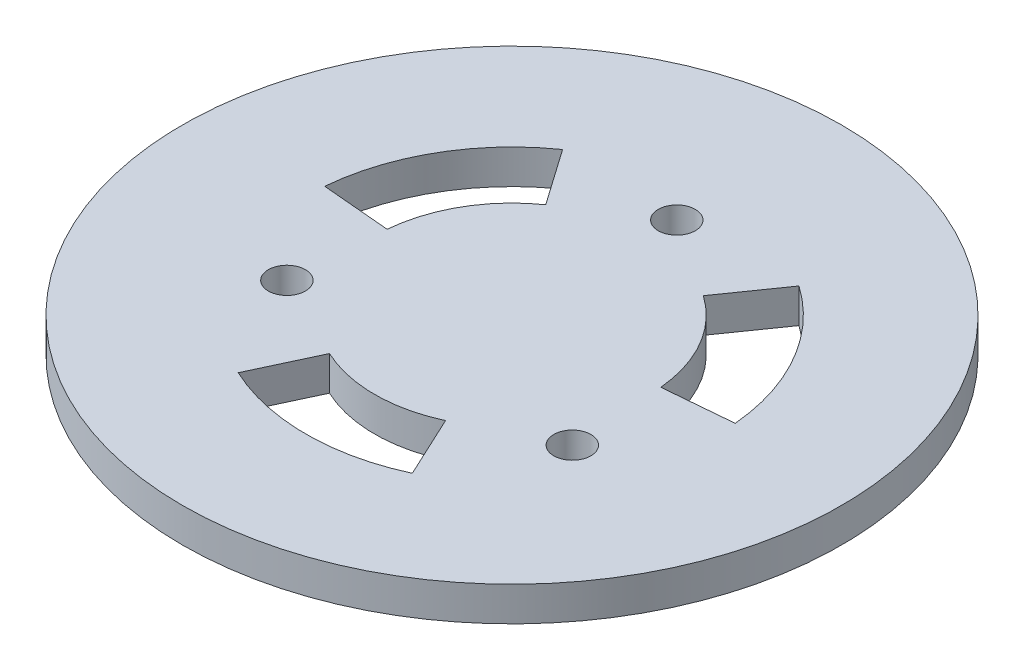
ISO-10303-21;
HEADER;
FILE_DESCRIPTION(('STEP AP214'),'2;1');
FILE_NAME('part.step','',(''),(''),'','','');
FILE_SCHEMA(('AUTOMOTIVE_DESIGN { 1 0 10303 214 1 1 1 1 }'));
ENDSEC;
DATA;
#1=APPLICATION_CONTEXT('core data for automotive mechanical design processes');
#2=APPLICATION_PROTOCOL_DEFINITION('international standard','automotive_design',2000,#1);
#3=PRODUCT_CONTEXT('',#1,'mechanical');
#4=PRODUCT('Part','Part','',(#3));
#5=PRODUCT_RELATED_PRODUCT_CATEGORY('part','',(#4));
#6=PRODUCT_DEFINITION_FORMATION('','',#4);
#7=PRODUCT_DEFINITION_CONTEXT('part definition',#1,'design');
#8=PRODUCT_DEFINITION('design','',#6,#7);
#9=PRODUCT_DEFINITION_SHAPE('','',#8);
#10=(LENGTH_UNIT() NAMED_UNIT(*) SI_UNIT(.MILLI.,.METRE.));
#11=(NAMED_UNIT(*) PLANE_ANGLE_UNIT() SI_UNIT($,.RADIAN.));
#12=(NAMED_UNIT(*) SI_UNIT($,.STERADIAN.) SOLID_ANGLE_UNIT());
#13=UNCERTAINTY_MEASURE_WITH_UNIT(LENGTH_MEASURE(1.E-05),#10,'distance_accuracy_value','');
#14=(GEOMETRIC_REPRESENTATION_CONTEXT(3) GLOBAL_UNCERTAINTY_ASSIGNED_CONTEXT((#13)) GLOBAL_UNIT_ASSIGNED_CONTEXT((#10,
#11,#12)) REPRESENTATION_CONTEXT('',''));
#15=CARTESIAN_POINT('',(0.,0.,0.));
#16=DIRECTION('',(0.,0.,1.));
#17=DIRECTION('',(1.,0.,0.));
#18=AXIS2_PLACEMENT_3D('',#15,#16,#17);
#19=CARTESIAN_POINT('',(0.,2.5,0.));
#20=DIRECTION('',(0.,1.,0.));
#21=DIRECTION('',(0.,0.,1.));
#22=AXIS2_PLACEMENT_3D('',#19,#20,#21);
#23=PLANE('',#22);
#24=CARTESIAN_POINT('',(0.,2.5,0.));
#25=DIRECTION('',(0.,1.,0.));
#26=DIRECTION('',(0.,0.,1.));
#27=AXIS2_PLACEMENT_3D('',#24,#25,#26);
#28=CIRCLE('',#27,15.);
#29=CARTESIAN_POINT('',(-8.60364654526553,2.5,-12.287280664335));
#30=VERTEX_POINT('',#29);
#31=CARTESIAN_POINT('',(-14.9429204713762,2.5,-1.30733614121502));
#32=VERTEX_POINT('',#31);
#33=EDGE_CURVE('E51',#30,#32,#28,.T.);
#34=ORIENTED_EDGE('',*,*,#33,.F.);
#35=DIRECTION('',(-0.573576436351035,0.,-0.819152044288999));
#36=VECTOR('',#35,1.);
#37=CARTESIAN_POINT('',(-5.73576436351036,2.5,-8.19152044288999));
#38=LINE('',#37,#36);
#39=CARTESIAN_POINT('',(-5.73576436351036,2.5,-8.19152044288999));
#40=VERTEX_POINT('',#39);
#41=EDGE_CURVE('E165',#40,#30,#38,.T.);
#42=ORIENTED_EDGE('',*,*,#41,.F.);
#43=CARTESIAN_POINT('',(0.,2.5,0.));
#44=DIRECTION('',(0.,-1.,0.));
#45=DIRECTION('',(0.,0.,1.));
#46=AXIS2_PLACEMENT_3D('',#43,#44,#45);
#47=CIRCLE('',#46,10.);
#48=CARTESIAN_POINT('',(-9.96194698091745,2.5,-0.871557427476689));
#49=VERTEX_POINT('',#48);
#50=EDGE_CURVE('E162',#49,#40,#47,.T.);
#51=ORIENTED_EDGE('',*,*,#50,.F.);
#52=DIRECTION('',(0.996194698091745,0.,0.0871557427476682));
#53=VECTOR('',#52,1.);
#54=CARTESIAN_POINT('',(-9.96194698091745,2.5,-0.871557427476683));
#55=LINE('',#54,#53);
#56=EDGE_CURVE('E159',#32,#49,#55,.T.);
#57=ORIENTED_EDGE('',*,*,#56,.F.);
#58=EDGE_LOOP('',(#34,#42,#51,#57));
#59=FACE_BOUND('',#58,.T.);
#60=CARTESIAN_POINT('',(0.,2.5,0.));
#61=DIRECTION('',(0.,1.,0.));
#62=DIRECTION('',(0.,0.,1.));
#63=AXIS2_PLACEMENT_3D('',#60,#61,#62);
#64=CIRCLE('',#63,15.);
#65=CARTESIAN_POINT('',(-6.3392739261106,2.5,13.5946168055497));
#66=VERTEX_POINT('',#65);
#67=CARTESIAN_POINT('',(6.33927392611042,2.5,13.5946168055498));
#68=VERTEX_POINT('',#67);
#69=EDGE_CURVE('E59',#66,#68,#64,.T.);
#70=ORIENTED_EDGE('',*,*,#69,.F.);
#71=DIRECTION('',(-0.422618261740707,0.,0.906307787036646));
#72=VECTOR('',#71,1.);
#73=CARTESIAN_POINT('',(-4.22618261740707,2.5,9.06307787036646));
#74=LINE('',#73,#72);
#75=CARTESIAN_POINT('',(-4.22618261740707,2.5,9.06307787036646));
#76=VERTEX_POINT('',#75);
#77=EDGE_CURVE('E148',#76,#66,#74,.T.);
#78=ORIENTED_EDGE('',*,*,#77,.F.);
#79=CARTESIAN_POINT('',(0.,2.5,0.));
#80=DIRECTION('',(0.,-1.,0.));
#81=DIRECTION('',(0.,0.,1.));
#82=AXIS2_PLACEMENT_3D('',#79,#80,#81);
#83=CIRCLE('',#82,10.);
#84=CARTESIAN_POINT('',(4.22618261740695,2.5,9.06307787036652));
#85=VERTEX_POINT('',#84);
#86=EDGE_CURVE('E132',#85,#76,#83,.T.);
#87=ORIENTED_EDGE('',*,*,#86,.F.);
#88=DIRECTION('',(-0.422618261740695,0.,-0.906307787036652));
#89=VECTOR('',#88,1.);
#90=CARTESIAN_POINT('',(4.22618261740695,2.5,9.06307787036653));
#91=LINE('',#90,#89);
#92=EDGE_CURVE('E142',#68,#85,#91,.T.);
#93=ORIENTED_EDGE('',*,*,#92,.F.);
#94=EDGE_LOOP('',(#70,#78,#87,#93));
#95=FACE_BOUND('',#94,.T.);
#96=CARTESIAN_POINT('',(0.,2.5,0.));
#97=DIRECTION('',(0.,1.,0.));
#98=DIRECTION('',(0.,0.,1.));
#99=AXIS2_PLACEMENT_3D('',#96,#97,#98);
#100=CIRCLE('',#99,15.);
#101=CARTESIAN_POINT('',(14.9429204713762,2.5,-1.30733614121482));
#102=VERTEX_POINT('',#101);
#103=CARTESIAN_POINT('',(8.6036465452657,2.5,-12.2872806643349));
#104=VERTEX_POINT('',#103);
#105=EDGE_CURVE('E155',#102,#104,#100,.T.);
#106=ORIENTED_EDGE('',*,*,#105,.F.);
#107=DIRECTION('',(0.996194698091746,0.,-0.0871557427476546));
#108=VECTOR('',#107,1.);
#109=CARTESIAN_POINT('',(9.96194698091746,2.5,-0.871557427476546));
#110=LINE('',#109,#108);
#111=CARTESIAN_POINT('',(9.96194698091746,2.5,-0.871557427476546));
#112=VERTEX_POINT('',#111);
#113=EDGE_CURVE('E183',#112,#102,#110,.T.);
#114=ORIENTED_EDGE('',*,*,#113,.F.);
#115=CARTESIAN_POINT('',(0.,2.5,0.));
#116=DIRECTION('',(0.,-1.,0.));
#117=DIRECTION('',(0.,0.,1.));
#118=AXIS2_PLACEMENT_3D('',#115,#116,#117);
#119=CIRCLE('',#118,10.);
#120=CARTESIAN_POINT('',(5.73576436351047,2.5,-8.19152044288991));
#121=VERTEX_POINT('',#120);
#122=EDGE_CURVE('E180',#121,#112,#119,.T.);
#123=ORIENTED_EDGE('',*,*,#122,.F.);
#124=DIRECTION('',(-0.573576436351047,0.,0.819152044288991));
#125=VECTOR('',#124,1.);
#126=CARTESIAN_POINT('',(5.73576436351047,2.5,-8.19152044288992));
#127=LINE('',#126,#125);
#128=EDGE_CURVE('E177',#104,#121,#127,.T.);
#129=ORIENTED_EDGE('',*,*,#128,.F.);
#130=EDGE_LOOP('',(#106,#114,#123,#129));
#131=FACE_BOUND('',#130,.T.);
#132=CARTESIAN_POINT('',(10.389135192436,2.5,5.99816999999967));
#133=DIRECTION('',(0.,1.,0.));
#134=DIRECTION('',(0.,0.,1.));
#135=AXIS2_PLACEMENT_3D('',#132,#133,#134);
#136=CIRCLE('',#135,1.35);
#137=CARTESIAN_POINT('',(10.389135192436,2.5,7.34816999999966));
#138=VERTEX_POINT('',#137);
#139=EDGE_CURVE('E202',#138,#138,#136,.T.);
#140=ORIENTED_EDGE('',*,*,#139,.F.);
#141=EDGE_LOOP('',(#140));
#142=FACE_BOUND('',#141,.T.);
#143=CARTESIAN_POINT('',(0.,2.5,0.));
#144=DIRECTION('',(0.,1.,0.));
#145=DIRECTION('',(0.,0.,1.));
#146=AXIS2_PLACEMENT_3D('',#143,#144,#145);
#147=CIRCLE('',#146,23.99268);
#148=CARTESIAN_POINT('',(0.,2.5,23.99268));
#149=VERTEX_POINT('',#148);
#150=EDGE_CURVE('E214',#149,#149,#147,.T.);
#151=ORIENTED_EDGE('',*,*,#150,.T.);
#152=EDGE_LOOP('',(#151));
#153=FACE_BOUND('',#152,.T.);
#154=CARTESIAN_POINT('',(0.,2.5,-11.99634));
#155=DIRECTION('',(0.,1.,0.));
#156=DIRECTION('',(0.,0.,1.));
#157=AXIS2_PLACEMENT_3D('',#154,#155,#156);
#158=CIRCLE('',#157,1.35);
#159=CARTESIAN_POINT('',(0.,2.5,-10.64634));
#160=VERTEX_POINT('',#159);
#161=EDGE_CURVE('E208',#160,#160,#158,.T.);
#162=ORIENTED_EDGE('',*,*,#161,.F.);
#163=EDGE_LOOP('',(#162));
#164=FACE_BOUND('',#163,.T.);
#165=CARTESIAN_POINT('',(-10.3891351924348,2.5,5.99817000000034));
#166=DIRECTION('',(0.,1.,0.));
#167=DIRECTION('',(0.,0.,1.));
#168=AXIS2_PLACEMENT_3D('',#165,#166,#167);
#169=CIRCLE('',#168,1.35);
#170=CARTESIAN_POINT('',(-10.3891351924348,2.5,7.34817000000034));
#171=VERTEX_POINT('',#170);
#172=EDGE_CURVE('E196',#171,#171,#169,.T.);
#173=ORIENTED_EDGE('',*,*,#172,.F.);
#174=EDGE_LOOP('',(#173));
#175=FACE_BOUND('',#174,.T.);
#176=ADVANCED_FACE('F36',(#59,#95,#131,#142,#153,#164,#175),#23,.T.);
#177=CARTESIAN_POINT('',(0.,0.,0.));
#178=DIRECTION('',(0.,1.,0.));
#179=DIRECTION('',(0.,0.,1.));
#180=AXIS2_PLACEMENT_3D('',#177,#178,#179);
#181=PLANE('',#180);
#182=DIRECTION('',(-0.573576436351036,0.,-0.819152044288999));
#183=VECTOR('',#182,1.);
#184=CARTESIAN_POINT('',(0.,0.,0.));
#185=LINE('',#184,#183);
#186=CARTESIAN_POINT('',(-5.73576436351036,0.,-8.19152044288999));
#187=VERTEX_POINT('',#186);
#188=CARTESIAN_POINT('',(-8.60364654526553,0.,-12.287280664335));
#189=VERTEX_POINT('',#188);
#190=EDGE_CURVE('E44',#187,#189,#185,.T.);
#191=ORIENTED_EDGE('',*,*,#190,.T.);
#192=CARTESIAN_POINT('',(0.,0.,0.));
#193=DIRECTION('',(0.,1.,0.));
#194=DIRECTION('',(0.,0.,1.));
#195=AXIS2_PLACEMENT_3D('',#192,#193,#194);
#196=CIRCLE('',#195,15.);
#197=CARTESIAN_POINT('',(-14.9429204713762,0.,-1.30733614121502));
#198=VERTEX_POINT('',#197);
#199=EDGE_CURVE('E11',#189,#198,#196,.T.);
#200=ORIENTED_EDGE('',*,*,#199,.T.);
#201=DIRECTION('',(0.996194698091745,0.,0.0871557427476682));
#202=VECTOR('',#201,1.);
#203=CARTESIAN_POINT('',(0.,0.,0.));
#204=LINE('',#203,#202);
#205=CARTESIAN_POINT('',(-9.96194698091745,0.,-0.871557427476682));
#206=VERTEX_POINT('',#205);
#207=EDGE_CURVE('E240',#198,#206,#204,.T.);
#208=ORIENTED_EDGE('',*,*,#207,.T.);
#209=CARTESIAN_POINT('',(0.,0.,0.));
#210=DIRECTION('',(0.,1.,0.));
#211=DIRECTION('',(0.,0.,1.));
#212=AXIS2_PLACEMENT_3D('',#209,#210,#211);
#213=CIRCLE('',#212,10.);
#214=EDGE_CURVE('E243',#206,#187,#213,.F.);
#215=ORIENTED_EDGE('',*,*,#214,.T.);
#216=EDGE_LOOP('',(#191,#200,#208,#215));
#217=FACE_BOUND('',#216,.T.);
#218=DIRECTION('',(-0.422618261740707,0.,0.906307787036647));
#219=VECTOR('',#218,1.);
#220=CARTESIAN_POINT('',(0.,0.,0.));
#221=LINE('',#220,#219);
#222=CARTESIAN_POINT('',(-4.22618261740707,0.,9.06307787036646));
#223=VERTEX_POINT('',#222);
#224=CARTESIAN_POINT('',(-6.3392739261106,0.,13.5946168055497));
#225=VERTEX_POINT('',#224);
#226=EDGE_CURVE('E234',#223,#225,#221,.T.);
#227=ORIENTED_EDGE('',*,*,#226,.T.);
#228=CARTESIAN_POINT('',(0.,0.,0.));
#229=DIRECTION('',(0.,1.,0.));
#230=DIRECTION('',(0.,0.,1.));
#231=AXIS2_PLACEMENT_3D('',#228,#229,#230);
#232=CIRCLE('',#231,15.);
#233=CARTESIAN_POINT('',(6.33927392611042,0.,13.5946168055498));
#234=VERTEX_POINT('',#233);
#235=EDGE_CURVE('E237',#225,#234,#232,.T.);
#236=ORIENTED_EDGE('',*,*,#235,.T.);
#237=DIRECTION('',(-0.422618261740695,0.,-0.906307787036652));
#238=VECTOR('',#237,1.);
#239=CARTESIAN_POINT('',(0.,0.,0.));
#240=LINE('',#239,#238);
#241=CARTESIAN_POINT('',(4.22618261740695,0.,9.06307787036652));
#242=VERTEX_POINT('',#241);
#243=EDGE_CURVE('E231',#234,#242,#240,.T.);
#244=ORIENTED_EDGE('',*,*,#243,.T.);
#245=CARTESIAN_POINT('',(0.,0.,0.));
#246=DIRECTION('',(0.,1.,0.));
#247=DIRECTION('',(0.,0.,1.));
#248=AXIS2_PLACEMENT_3D('',#245,#246,#247);
#249=CIRCLE('',#248,10.);
#250=EDGE_CURVE('E135',#242,#223,#249,.F.);
#251=ORIENTED_EDGE('',*,*,#250,.T.);
#252=EDGE_LOOP('',(#227,#236,#244,#251));
#253=FACE_BOUND('',#252,.T.);
#254=DIRECTION('',(0.996194698091746,0.,-0.0871557427476546));
#255=VECTOR('',#254,1.);
#256=CARTESIAN_POINT('',(0.,0.,0.));
#257=LINE('',#256,#255);
#258=CARTESIAN_POINT('',(9.96194698091746,0.,-0.871557427476546));
#259=VERTEX_POINT('',#258);
#260=CARTESIAN_POINT('',(14.9429204713762,0.,-1.30733614121482));
#261=VERTEX_POINT('',#260);
#262=EDGE_CURVE('E225',#259,#261,#257,.T.);
#263=ORIENTED_EDGE('',*,*,#262,.T.);
#264=CARTESIAN_POINT('',(0.,0.,0.));
#265=DIRECTION('',(0.,1.,0.));
#266=DIRECTION('',(0.,0.,1.));
#267=AXIS2_PLACEMENT_3D('',#264,#265,#266);
#268=CIRCLE('',#267,15.);
#269=CARTESIAN_POINT('',(8.6036465452657,0.,-12.2872806643349));
#270=VERTEX_POINT('',#269);
#271=EDGE_CURVE('E228',#261,#270,#268,.T.);
#272=ORIENTED_EDGE('',*,*,#271,.T.);
#273=DIRECTION('',(-0.573576436351047,0.,0.819152044288991));
#274=VECTOR('',#273,1.);
#275=CARTESIAN_POINT('',(0.,0.,0.));
#276=LINE('',#275,#274);
#277=CARTESIAN_POINT('',(5.73576436351047,0.,-8.19152044288991));
#278=VERTEX_POINT('',#277);
#279=EDGE_CURVE('E217',#270,#278,#276,.T.);
#280=ORIENTED_EDGE('',*,*,#279,.T.);
#281=CARTESIAN_POINT('',(0.,0.,0.));
#282=DIRECTION('',(0.,1.,0.));
#283=DIRECTION('',(0.,0.,1.));
#284=AXIS2_PLACEMENT_3D('',#281,#282,#283);
#285=CIRCLE('',#284,10.);
#286=EDGE_CURVE('E222',#278,#259,#285,.F.);
#287=ORIENTED_EDGE('',*,*,#286,.T.);
#288=EDGE_LOOP('',(#263,#272,#280,#287));
#289=FACE_BOUND('',#288,.T.);
#290=CARTESIAN_POINT('',(0.,0.,0.));
#291=DIRECTION('',(0.,1.,0.));
#292=DIRECTION('',(0.,0.,1.));
#293=AXIS2_PLACEMENT_3D('',#290,#291,#292);
#294=CIRCLE('',#293,23.99268);
#295=CARTESIAN_POINT('',(0.,0.,23.99268));
#296=VERTEX_POINT('',#295);
#297=EDGE_CURVE('E211',#296,#296,#294,.T.);
#298=ORIENTED_EDGE('',*,*,#297,.F.);
#299=EDGE_LOOP('',(#298));
#300=FACE_BOUND('',#299,.T.);
#301=CARTESIAN_POINT('',(0.,0.,-11.99634));
#302=DIRECTION('',(0.,1.,0.));
#303=DIRECTION('',(0.,0.,1.));
#304=AXIS2_PLACEMENT_3D('',#301,#302,#303);
#305=CIRCLE('',#304,1.35);
#306=CARTESIAN_POINT('',(0.,0.,-10.64634));
#307=VERTEX_POINT('',#306);
#308=EDGE_CURVE('E205',#307,#307,#305,.T.);
#309=ORIENTED_EDGE('',*,*,#308,.T.);
#310=EDGE_LOOP('',(#309));
#311=FACE_BOUND('',#310,.T.);
#312=CARTESIAN_POINT('',(10.389135192436,0.,5.99816999999967));
#313=DIRECTION('',(0.,1.,0.));
#314=DIRECTION('',(0.,0.,1.));
#315=AXIS2_PLACEMENT_3D('',#312,#313,#314);
#316=CIRCLE('',#315,1.35);
#317=CARTESIAN_POINT('',(10.389135192436,0.,7.34816999999966));
#318=VERTEX_POINT('',#317);
#319=EDGE_CURVE('E199',#318,#318,#316,.T.);
#320=ORIENTED_EDGE('',*,*,#319,.T.);
#321=EDGE_LOOP('',(#320));
#322=FACE_BOUND('',#321,.T.);
#323=CARTESIAN_POINT('',(-10.3891351924348,0.,5.99817000000034));
#324=DIRECTION('',(0.,1.,0.));
#325=DIRECTION('',(0.,0.,1.));
#326=AXIS2_PLACEMENT_3D('',#323,#324,#325);
#327=CIRCLE('',#326,1.35);
#328=CARTESIAN_POINT('',(-10.3891351924348,0.,7.34817000000034));
#329=VERTEX_POINT('',#328);
#330=EDGE_CURVE('E189',#329,#329,#327,.T.);
#331=ORIENTED_EDGE('',*,*,#330,.T.);
#332=EDGE_LOOP('',(#331));
#333=FACE_BOUND('',#332,.T.);
#334=ADVANCED_FACE('F247',(#217,#253,#289,#300,#311,#322,#333),#181,.F.);
#335=CARTESIAN_POINT('',(0.,2.5,0.));
#336=DIRECTION('',(0.,-1.,0.));
#337=DIRECTION('',(0.,0.,-1.));
#338=AXIS2_PLACEMENT_3D('',#335,#336,#337);
#339=CYLINDRICAL_SURFACE('',#338,23.99268);
#340=ORIENTED_EDGE('',*,*,#150,.F.);
#341=EDGE_LOOP('',(#340));
#342=FACE_BOUND('',#341,.T.);
#343=ORIENTED_EDGE('',*,*,#297,.T.);
#344=EDGE_LOOP('',(#343));
#345=FACE_BOUND('',#344,.T.);
#346=ADVANCED_FACE('F38',(#342,#345),#339,.T.);
#347=CARTESIAN_POINT('',(0.,2.5,-11.99634));
#348=DIRECTION('',(0.,-1.,0.));
#349=DIRECTION('',(0.,0.,-1.));
#350=AXIS2_PLACEMENT_3D('',#347,#348,#349);
#351=CYLINDRICAL_SURFACE('',#350,1.35);
#352=ORIENTED_EDGE('',*,*,#161,.T.);
#353=EDGE_LOOP('',(#352));
#354=FACE_BOUND('',#353,.T.);
#355=ORIENTED_EDGE('',*,*,#308,.F.);
#356=EDGE_LOOP('',(#355));
#357=FACE_BOUND('',#356,.T.);
#358=ADVANCED_FACE('F279',(#354,#357),#351,.F.);
#359=CARTESIAN_POINT('',(10.389135192436,2.5,5.99816999999967));
#360=DIRECTION('',(0.,-1.,0.));
#361=DIRECTION('',(0.,0.,-1.));
#362=AXIS2_PLACEMENT_3D('',#359,#360,#361);
#363=CYLINDRICAL_SURFACE('',#362,1.35);
#364=ORIENTED_EDGE('',*,*,#139,.T.);
#365=EDGE_LOOP('',(#364));
#366=FACE_BOUND('',#365,.T.);
#367=ORIENTED_EDGE('',*,*,#319,.F.);
#368=EDGE_LOOP('',(#367));
#369=FACE_BOUND('',#368,.T.);
#370=ADVANCED_FACE('F282',(#366,#369),#363,.F.);
#371=CARTESIAN_POINT('',(-10.3891351924348,2.5,5.99817000000034));
#372=DIRECTION('',(0.,-1.,0.));
#373=DIRECTION('',(0.,0.,-1.));
#374=AXIS2_PLACEMENT_3D('',#371,#372,#373);
#375=CYLINDRICAL_SURFACE('',#374,1.35);
#376=ORIENTED_EDGE('',*,*,#172,.T.);
#377=EDGE_LOOP('',(#376));
#378=FACE_BOUND('',#377,.T.);
#379=ORIENTED_EDGE('',*,*,#330,.F.);
#380=EDGE_LOOP('',(#379));
#381=FACE_BOUND('',#380,.T.);
#382=ADVANCED_FACE('F286',(#378,#381),#375,.F.);
#383=CARTESIAN_POINT('',(0.,-7.5,0.));
#384=DIRECTION('',(0.,1.,0.));
#385=DIRECTION('',(0.,0.,1.));
#386=AXIS2_PLACEMENT_3D('',#383,#384,#385);
#387=CYLINDRICAL_SURFACE('',#386,15.);
#388=DIRECTION('',(0.,1.,0.));
#389=VECTOR('',#388,1.);
#390=CARTESIAN_POINT('',(14.9429204713762,-7.5,-1.30733614121482));
#391=LINE('',#390,#389);
#392=EDGE_CURVE('E187',#261,#102,#391,.T.);
#393=ORIENTED_EDGE('',*,*,#392,.T.);
#394=ORIENTED_EDGE('',*,*,#105,.T.);
#395=DIRECTION('',(0.,1.,0.));
#396=VECTOR('',#395,1.);
#397=CARTESIAN_POINT('',(8.6036465452657,-7.5,-12.2872806643349));
#398=LINE('',#397,#396);
#399=EDGE_CURVE('E186',#270,#104,#398,.T.);
#400=ORIENTED_EDGE('',*,*,#399,.F.);
#401=ORIENTED_EDGE('',*,*,#271,.F.);
#402=EDGE_LOOP('',(#393,#394,#400,#401));
#403=FACE_BOUND('',#402,.T.);
#404=ADVANCED_FACE('F290',(#403),#387,.F.);
#405=CARTESIAN_POINT('',(9.96194698091746,-7.5,-0.871557427476546));
#406=DIRECTION('',(0.0871557427476546,0.,0.996194698091746));
#407=DIRECTION('',(0.996194698091746,0.,-0.0871557427476546));
#408=AXIS2_PLACEMENT_3D('',#405,#406,#407);
#409=PLANE('',#408);
#410=DIRECTION('',(0.,1.,0.));
#411=VECTOR('',#410,1.);
#412=CARTESIAN_POINT('',(9.96194698091746,-7.5,-0.871557427476546));
#413=LINE('',#412,#411);
#414=EDGE_CURVE('E190',#259,#112,#413,.T.);
#415=ORIENTED_EDGE('',*,*,#414,.T.);
#416=ORIENTED_EDGE('',*,*,#113,.T.);
#417=ORIENTED_EDGE('',*,*,#392,.F.);
#418=ORIENTED_EDGE('',*,*,#262,.F.);
#419=EDGE_LOOP('',(#415,#416,#417,#418));
#420=FACE_BOUND('',#419,.T.);
#421=ADVANCED_FACE('F294',(#420),#409,.F.);
#422=CARTESIAN_POINT('',(0.,-7.5,0.));
#423=DIRECTION('',(0.,1.,0.));
#424=DIRECTION('',(0.,0.,1.));
#425=AXIS2_PLACEMENT_3D('',#422,#423,#424);
#426=CYLINDRICAL_SURFACE('',#425,10.);
#427=DIRECTION('',(0.,1.,0.));
#428=VECTOR('',#427,1.);
#429=CARTESIAN_POINT('',(5.73576436351047,-7.5,-8.19152044288991));
#430=LINE('',#429,#428);
#431=EDGE_CURVE('E192',#278,#121,#430,.T.);
#432=ORIENTED_EDGE('',*,*,#431,.T.);
#433=ORIENTED_EDGE('',*,*,#122,.T.);
#434=ORIENTED_EDGE('',*,*,#414,.F.);
#435=ORIENTED_EDGE('',*,*,#286,.F.);
#436=EDGE_LOOP('',(#432,#433,#434,#435));
#437=FACE_BOUND('',#436,.T.);
#438=ADVANCED_FACE('F300',(#437),#426,.T.);
#439=CARTESIAN_POINT('',(5.73576436351047,-7.5,-8.19152044288992));
#440=DIRECTION('',(-0.819152044288991,0.,-0.573576436351047));
#441=DIRECTION('',(-0.573576436351047,0.,0.819152044288991));
#442=AXIS2_PLACEMENT_3D('',#439,#440,#441);
#443=PLANE('',#442);
#444=ORIENTED_EDGE('',*,*,#399,.T.);
#445=ORIENTED_EDGE('',*,*,#128,.T.);
#446=ORIENTED_EDGE('',*,*,#431,.F.);
#447=ORIENTED_EDGE('',*,*,#279,.F.);
#448=EDGE_LOOP('',(#444,#445,#446,#447));
#449=FACE_BOUND('',#448,.T.);
#450=ADVANCED_FACE('F296',(#449),#443,.F.);
#451=CARTESIAN_POINT('',(0.,-7.5,0.));
#452=DIRECTION('',(0.,1.,0.));
#453=DIRECTION('',(0.,0.,1.));
#454=AXIS2_PLACEMENT_3D('',#451,#452,#453);
#455=CYLINDRICAL_SURFACE('',#454,15.);
#456=DIRECTION('',(0.,1.,0.));
#457=VECTOR('',#456,1.);
#458=CARTESIAN_POINT('',(-6.3392739261106,-7.5,13.5946168055497));
#459=LINE('',#458,#457);
#460=EDGE_CURVE('E153',#225,#66,#459,.T.);
#461=ORIENTED_EDGE('',*,*,#460,.T.);
#462=ORIENTED_EDGE('',*,*,#69,.T.);
#463=DIRECTION('',(0.,1.,0.));
#464=VECTOR('',#463,1.);
#465=CARTESIAN_POINT('',(6.33927392611042,-7.5,13.5946168055498));
#466=LINE('',#465,#464);
#467=EDGE_CURVE('E139',#234,#68,#466,.T.);
#468=ORIENTED_EDGE('',*,*,#467,.F.);
#469=ORIENTED_EDGE('',*,*,#235,.F.);
#470=EDGE_LOOP('',(#461,#462,#468,#469));
#471=FACE_BOUND('',#470,.T.);
#472=ADVANCED_FACE('F299',(#471),#455,.F.);
#473=CARTESIAN_POINT('',(-4.22618261740707,-7.5,9.06307787036646));
#474=DIRECTION('',(-0.906307787036647,0.,-0.422618261740707));
#475=DIRECTION('',(-0.422618261740707,0.,0.906307787036647));
#476=AXIS2_PLACEMENT_3D('',#473,#474,#475);
#477=PLANE('',#476);
#478=DIRECTION('',(0.,1.,0.));
#479=VECTOR('',#478,1.);
#480=CARTESIAN_POINT('',(-4.22618261740707,-7.5,9.06307787036646));
#481=LINE('',#480,#479);
#482=EDGE_CURVE('E138',#223,#76,#481,.T.);
#483=ORIENTED_EDGE('',*,*,#482,.T.);
#484=ORIENTED_EDGE('',*,*,#77,.T.);
#485=ORIENTED_EDGE('',*,*,#460,.F.);
#486=ORIENTED_EDGE('',*,*,#226,.F.);
#487=EDGE_LOOP('',(#483,#484,#485,#486));
#488=FACE_BOUND('',#487,.T.);
#489=ADVANCED_FACE('F385',(#488),#477,.F.);
#490=CARTESIAN_POINT('',(0.,-7.5,0.));
#491=DIRECTION('',(0.,1.,0.));
#492=DIRECTION('',(0.,0.,1.));
#493=AXIS2_PLACEMENT_3D('',#490,#491,#492);
#494=CYLINDRICAL_SURFACE('',#493,10.);
#495=DIRECTION('',(0.,1.,0.));
#496=VECTOR('',#495,1.);
#497=CARTESIAN_POINT('',(4.22618261740695,-7.5,9.06307787036652));
#498=LINE('',#497,#496);
#499=EDGE_CURVE('E127',#242,#85,#498,.T.);
#500=ORIENTED_EDGE('',*,*,#499,.T.);
#501=ORIENTED_EDGE('',*,*,#86,.T.);
#502=ORIENTED_EDGE('',*,*,#482,.F.);
#503=ORIENTED_EDGE('',*,*,#250,.F.);
#504=EDGE_LOOP('',(#500,#501,#502,#503));
#505=FACE_BOUND('',#504,.T.);
#506=ADVANCED_FACE('F129',(#505),#494,.T.);
#507=CARTESIAN_POINT('',(4.22618261740695,-7.5,9.06307787036653));
#508=DIRECTION('',(0.906307787036652,0.,-0.422618261740695));
#509=DIRECTION('',(-0.422618261740695,0.,-0.906307787036652));
#510=AXIS2_PLACEMENT_3D('',#507,#508,#509);
#511=PLANE('',#510);
#512=ORIENTED_EDGE('',*,*,#467,.T.);
#513=ORIENTED_EDGE('',*,*,#92,.T.);
#514=ORIENTED_EDGE('',*,*,#499,.F.);
#515=ORIENTED_EDGE('',*,*,#243,.F.);
#516=EDGE_LOOP('',(#512,#513,#514,#515));
#517=FACE_BOUND('',#516,.T.);
#518=ADVANCED_FACE('F143',(#517),#511,.F.);
#519=CARTESIAN_POINT('',(0.,-7.5,0.));
#520=DIRECTION('',(0.,1.,0.));
#521=DIRECTION('',(0.,0.,1.));
#522=AXIS2_PLACEMENT_3D('',#519,#520,#521);
#523=CYLINDRICAL_SURFACE('',#522,15.);
#524=DIRECTION('',(0.,1.,0.));
#525=VECTOR('',#524,1.);
#526=CARTESIAN_POINT('',(-8.60364654526553,-7.5,-12.287280664335));
#527=LINE('',#526,#525);
#528=EDGE_CURVE('E169',#189,#30,#527,.T.);
#529=ORIENTED_EDGE('',*,*,#528,.T.);
#530=ORIENTED_EDGE('',*,*,#33,.T.);
#531=DIRECTION('',(0.,1.,0.));
#532=VECTOR('',#531,1.);
#533=CARTESIAN_POINT('',(-14.9429204713762,-7.5,-1.30733614121502));
#534=LINE('',#533,#532);
#535=EDGE_CURVE('E168',#198,#32,#534,.T.);
#536=ORIENTED_EDGE('',*,*,#535,.F.);
#537=ORIENTED_EDGE('',*,*,#199,.F.);
#538=EDGE_LOOP('',(#529,#530,#536,#537));
#539=FACE_BOUND('',#538,.T.);
#540=ADVANCED_FACE('F262',(#539),#523,.F.);
#541=CARTESIAN_POINT('',(-5.73576436351036,-7.5,-8.19152044288999));
#542=DIRECTION('',(0.819152044288999,0.,-0.573576436351035));
#543=DIRECTION('',(-0.573576436351036,0.,-0.819152044288999));
#544=AXIS2_PLACEMENT_3D('',#541,#542,#543);
#545=PLANE('',#544);
#546=DIRECTION('',(0.,1.,0.));
#547=VECTOR('',#546,1.);
#548=CARTESIAN_POINT('',(-5.73576436351036,-7.5,-8.19152044288999));
#549=LINE('',#548,#547);
#550=EDGE_CURVE('E171',#187,#40,#549,.T.);
#551=ORIENTED_EDGE('',*,*,#550,.T.);
#552=ORIENTED_EDGE('',*,*,#41,.T.);
#553=ORIENTED_EDGE('',*,*,#528,.F.);
#554=ORIENTED_EDGE('',*,*,#190,.F.);
#555=EDGE_LOOP('',(#551,#552,#553,#554));
#556=FACE_BOUND('',#555,.T.);
#557=ADVANCED_FACE('F253',(#556),#545,.F.);
#558=CARTESIAN_POINT('',(0.,-7.5,0.));
#559=DIRECTION('',(0.,1.,0.));
#560=DIRECTION('',(0.,0.,1.));
#561=AXIS2_PLACEMENT_3D('',#558,#559,#560);
#562=CYLINDRICAL_SURFACE('',#561,10.);
#563=DIRECTION('',(0.,1.,0.));
#564=VECTOR('',#563,1.);
#565=CARTESIAN_POINT('',(-9.96194698091745,-7.5,-0.871557427476689));
#566=LINE('',#565,#564);
#567=EDGE_CURVE('E173',#206,#49,#566,.T.);
#568=ORIENTED_EDGE('',*,*,#567,.T.);
#569=ORIENTED_EDGE('',*,*,#50,.T.);
#570=ORIENTED_EDGE('',*,*,#550,.F.);
#571=ORIENTED_EDGE('',*,*,#214,.F.);
#572=EDGE_LOOP('',(#568,#569,#570,#571));
#573=FACE_BOUND('',#572,.T.);
#574=ADVANCED_FACE('F255',(#573),#562,.T.);
#575=CARTESIAN_POINT('',(-9.96194698091745,-7.5,-0.871557427476683));
#576=DIRECTION('',(-0.0871557427476682,0.,0.996194698091745));
#577=DIRECTION('',(0.996194698091745,0.,0.0871557427476682));
#578=AXIS2_PLACEMENT_3D('',#575,#576,#577);
#579=PLANE('',#578);
#580=ORIENTED_EDGE('',*,*,#535,.T.);
#581=ORIENTED_EDGE('',*,*,#56,.T.);
#582=ORIENTED_EDGE('',*,*,#567,.F.);
#583=ORIENTED_EDGE('',*,*,#207,.F.);
#584=EDGE_LOOP('',(#580,#581,#582,#583));
#585=FACE_BOUND('',#584,.T.);
#586=ADVANCED_FACE('F261',(#585),#579,.F.);
#587=CLOSED_SHELL('',(#176,#334,#346,#358,#370,#382,#404,#421,#438,#450,#472,#489,#506,#518,
#540,#557,#574,#586));
#588=MANIFOLD_SOLID_BREP('B2',#587);
#589=ADVANCED_BREP_SHAPE_REPRESENTATION('',(#18,#588),#14);
#590=SHAPE_DEFINITION_REPRESENTATION(#9,#589);
ENDSEC;
END-ISO-10303-21;
